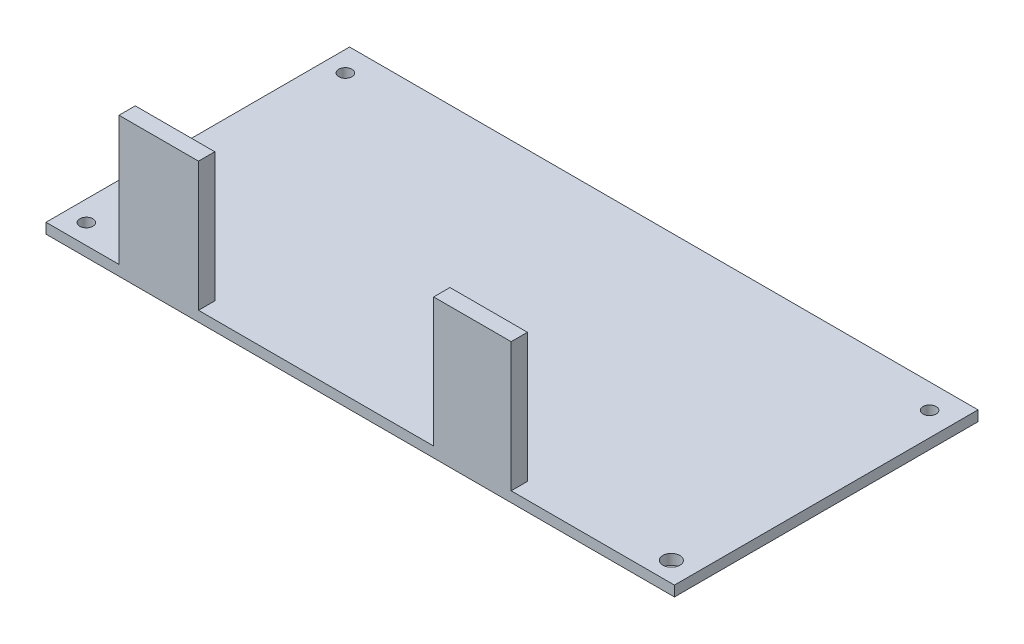
ISO-10303-21;
HEADER;
FILE_DESCRIPTION(('STEP AP214'),'2;1');
FILE_NAME('part.step','',(''),(''),'','','');
FILE_SCHEMA(('AUTOMOTIVE_DESIGN { 1 0 10303 214 1 1 1 1 }'));
ENDSEC;
DATA;
#1=APPLICATION_CONTEXT('core data for automotive mechanical design processes');
#2=APPLICATION_PROTOCOL_DEFINITION('international standard','automotive_design',2000,#1);
#3=PRODUCT_CONTEXT('',#1,'mechanical');
#4=PRODUCT('Part','Part','',(#3));
#5=PRODUCT_RELATED_PRODUCT_CATEGORY('part','',(#4));
#6=PRODUCT_DEFINITION_FORMATION('','',#4);
#7=PRODUCT_DEFINITION_CONTEXT('part definition',#1,'design');
#8=PRODUCT_DEFINITION('design','',#6,#7);
#9=PRODUCT_DEFINITION_SHAPE('','',#8);
#10=(LENGTH_UNIT() NAMED_UNIT(*) SI_UNIT(.MILLI.,.METRE.));
#11=(NAMED_UNIT(*) PLANE_ANGLE_UNIT() SI_UNIT($,.RADIAN.));
#12=(NAMED_UNIT(*) SI_UNIT($,.STERADIAN.) SOLID_ANGLE_UNIT());
#13=UNCERTAINTY_MEASURE_WITH_UNIT(LENGTH_MEASURE(1.E-05),#10,'distance_accuracy_value','');
#14=(GEOMETRIC_REPRESENTATION_CONTEXT(3) GLOBAL_UNCERTAINTY_ASSIGNED_CONTEXT((#13)) GLOBAL_UNIT_ASSIGNED_CONTEXT((#10,
#11,#12)) REPRESENTATION_CONTEXT('',''));
#15=CARTESIAN_POINT('',(0.,0.,0.));
#16=DIRECTION('',(0.,0.,1.));
#17=DIRECTION('',(1.,0.,0.));
#18=AXIS2_PLACEMENT_3D('',#15,#16,#17);
#19=CARTESIAN_POINT('',(0.,1.6,0.));
#20=DIRECTION('',(0.,1.,0.));
#21=DIRECTION('',(0.,0.,1.));
#22=AXIS2_PLACEMENT_3D('',#19,#20,#21);
#23=PLANE('',#22);
#24=CARTESIAN_POINT('',(93.617,1.6,3.81));
#25=DIRECTION('',(0.,1.,0.));
#26=DIRECTION('',(0.,0.,1.));
#27=AXIS2_PLACEMENT_3D('',#24,#25,#26);
#28=CIRCLE('',#27,1.016);
#29=CARTESIAN_POINT('',(93.617,1.6,4.826));
#30=VERTEX_POINT('',#29);
#31=EDGE_CURVE('E387',#30,#30,#28,.T.);
#32=ORIENTED_EDGE('',*,*,#31,.F.);
#33=EDGE_LOOP('',(#32));
#34=FACE_BOUND('',#33,.T.);
#35=CARTESIAN_POINT('',(93.744,1.6,43.916));
#36=DIRECTION('',(0.,1.,0.));
#37=DIRECTION('',(0.,0.,1.));
#38=AXIS2_PLACEMENT_3D('',#35,#36,#37);
#39=CIRCLE('',#38,1.316);
#40=CARTESIAN_POINT('',(93.744,1.6,45.232));
#41=VERTEX_POINT('',#40);
#42=EDGE_CURVE('E393',#41,#41,#39,.T.);
#43=ORIENTED_EDGE('',*,*,#42,.F.);
#44=EDGE_LOOP('',(#43));
#45=FACE_BOUND('',#44,.T.);
#46=CARTESIAN_POINT('',(3.16,1.6,43.916));
#47=DIRECTION('',(0.,1.,0.));
#48=DIRECTION('',(0.,0.,1.));
#49=AXIS2_PLACEMENT_3D('',#46,#47,#48);
#50=CIRCLE('',#49,1.016);
#51=CARTESIAN_POINT('',(3.16,1.6,44.932));
#52=VERTEX_POINT('',#51);
#53=EDGE_CURVE('E401',#52,#52,#50,.T.);
#54=ORIENTED_EDGE('',*,*,#53,.F.);
#55=EDGE_LOOP('',(#54));
#56=FACE_BOUND('',#55,.T.);
#57=CARTESIAN_POINT('',(3.16,1.6,3.81));
#58=DIRECTION('',(0.,1.,0.));
#59=DIRECTION('',(0.,0.,1.));
#60=AXIS2_PLACEMENT_3D('',#57,#58,#59);
#61=CIRCLE('',#60,1.016);
#62=CARTESIAN_POINT('',(3.16,1.6,4.826));
#63=VERTEX_POINT('',#62);
#64=EDGE_CURVE('E390',#63,#63,#61,.T.);
#65=ORIENTED_EDGE('',*,*,#64,.F.);
#66=EDGE_LOOP('',(#65));
#67=FACE_BOUND('',#66,.T.);
#68=DIRECTION('',(1.,0.,0.));
#69=VECTOR('',#68,1.);
#70=CARTESIAN_POINT('',(0.,1.6,47.));
#71=LINE('',#70,#69);
#72=CARTESIAN_POINT('',(23.6114774653231,1.6,47.));
#73=VERTEX_POINT('',#72);
#74=CARTESIAN_POINT('',(60.0201337686883,1.6,47.));
#75=VERTEX_POINT('',#74);
#76=EDGE_CURVE('E188',#73,#75,#71,.T.);
#77=ORIENTED_EDGE('',*,*,#76,.T.);
#78=DIRECTION('',(0.,0.,1.));
#79=VECTOR('',#78,1.);
#80=CARTESIAN_POINT('',(60.0201337686883,1.6,47.));
#81=LINE('',#80,#79);
#82=CARTESIAN_POINT('',(60.0201337686883,1.6,44.4786423259416));
#83=VERTEX_POINT('',#82);
#84=EDGE_CURVE('E146',#83,#75,#81,.T.);
#85=ORIENTED_EDGE('',*,*,#84,.F.);
#86=DIRECTION('',(-1.,0.,0.));
#87=VECTOR('',#86,1.);
#88=CARTESIAN_POINT('',(60.0201337686883,1.6,44.4786423259416));
#89=LINE('',#88,#87);
#90=CARTESIAN_POINT('',(72.0180133010615,1.6,44.4786423259416));
#91=VERTEX_POINT('',#90);
#92=EDGE_CURVE('E142',#91,#83,#89,.T.);
#93=ORIENTED_EDGE('',*,*,#92,.F.);
#94=DIRECTION('',(0.,0.,-1.));
#95=VECTOR('',#94,1.);
#96=CARTESIAN_POINT('',(72.0180133010615,1.6,47.));
#97=LINE('',#96,#95);
#98=CARTESIAN_POINT('',(72.0180133010615,1.6,47.));
#99=VERTEX_POINT('',#98);
#100=EDGE_CURVE('E224',#99,#91,#97,.T.);
#101=ORIENTED_EDGE('',*,*,#100,.F.);
#102=CARTESIAN_POINT('',(97.3,1.6,47.));
#103=VERTEX_POINT('',#102);
#104=EDGE_CURVE('E183',#99,#103,#71,.T.);
#105=ORIENTED_EDGE('',*,*,#104,.T.);
#106=DIRECTION('',(0.,0.,-1.));
#107=VECTOR('',#106,1.);
#108=CARTESIAN_POINT('',(97.3,1.6,0.));
#109=LINE('',#108,#107);
#110=CARTESIAN_POINT('',(97.3,1.6,0.));
#111=VERTEX_POINT('',#110);
#112=EDGE_CURVE('E187',#103,#111,#109,.T.);
#113=ORIENTED_EDGE('',*,*,#112,.T.);
#114=DIRECTION('',(-1.,0.,0.));
#115=VECTOR('',#114,1.);
#116=CARTESIAN_POINT('',(0.,1.6,0.));
#117=LINE('',#116,#115);
#118=CARTESIAN_POINT('',(0.,1.6,0.));
#119=VERTEX_POINT('',#118);
#120=EDGE_CURVE('E190',#111,#119,#117,.T.);
#121=ORIENTED_EDGE('',*,*,#120,.T.);
#122=DIRECTION('',(0.,0.,1.));
#123=VECTOR('',#122,1.);
#124=CARTESIAN_POINT('',(0.,1.6,0.));
#125=LINE('',#124,#123);
#126=CARTESIAN_POINT('',(0.,1.6,47.));
#127=VERTEX_POINT('',#126);
#128=EDGE_CURVE('E180',#119,#127,#125,.T.);
#129=ORIENTED_EDGE('',*,*,#128,.T.);
#130=CARTESIAN_POINT('',(11.3007204590474,1.6,47.));
#131=VERTEX_POINT('',#130);
#132=EDGE_CURVE('E185',#127,#131,#71,.T.);
#133=ORIENTED_EDGE('',*,*,#132,.T.);
#134=DIRECTION('',(0.,0.,1.));
#135=VECTOR('',#134,1.);
#136=CARTESIAN_POINT('',(11.3007204590474,1.6,47.));
#137=LINE('',#136,#135);
#138=CARTESIAN_POINT('',(11.3007204590474,1.6,44.4786423259416));
#139=VERTEX_POINT('',#138);
#140=EDGE_CURVE('E56',#139,#131,#137,.T.);
#141=ORIENTED_EDGE('',*,*,#140,.F.);
#142=DIRECTION('',(-1.,0.,0.));
#143=VECTOR('',#142,1.);
#144=CARTESIAN_POINT('',(11.3007204590474,1.6,44.4786423259416));
#145=LINE('',#144,#143);
#146=CARTESIAN_POINT('',(23.6114774653231,1.6,44.4786423259416));
#147=VERTEX_POINT('',#146);
#148=EDGE_CURVE('E158',#147,#139,#145,.T.);
#149=ORIENTED_EDGE('',*,*,#148,.F.);
#150=DIRECTION('',(0.,0.,-1.));
#151=VECTOR('',#150,1.);
#152=CARTESIAN_POINT('',(23.6114774653231,1.6,47.));
#153=LINE('',#152,#151);
#154=EDGE_CURVE('E149',#73,#147,#153,.T.);
#155=ORIENTED_EDGE('',*,*,#154,.F.);
#156=EDGE_LOOP('',(#77,#85,#93,#101,#105,#113,#121,#129,#133,#141,#149,#155));
#157=FACE_BOUND('',#156,.T.);
#158=ADVANCED_FACE('F33',(#34,#45,#56,#67,#157),#23,.T.);
#159=CARTESIAN_POINT('',(0.,1.6,0.));
#160=DIRECTION('',(1.,0.,0.));
#161=DIRECTION('',(0.,0.,-1.));
#162=AXIS2_PLACEMENT_3D('',#159,#160,#161);
#163=PLANE('',#162);
#164=DIRECTION('',(0.,0.,1.));
#165=VECTOR('',#164,1.);
#166=CARTESIAN_POINT('',(0.,0.,0.));
#167=LINE('',#166,#165);
#168=CARTESIAN_POINT('',(0.,0.,0.));
#169=VERTEX_POINT('',#168);
#170=CARTESIAN_POINT('',(0.,0.,47.));
#171=VERTEX_POINT('',#170);
#172=EDGE_CURVE('E179',#169,#171,#167,.T.);
#173=ORIENTED_EDGE('',*,*,#172,.T.);
#174=DIRECTION('',(0.,-1.,0.));
#175=VECTOR('',#174,1.);
#176=CARTESIAN_POINT('',(0.,1.6,47.));
#177=LINE('',#176,#175);
#178=EDGE_CURVE('E11',#127,#171,#177,.T.);
#179=ORIENTED_EDGE('',*,*,#178,.F.);
#180=ORIENTED_EDGE('',*,*,#128,.F.);
#181=DIRECTION('',(0.,-1.,0.));
#182=VECTOR('',#181,1.);
#183=CARTESIAN_POINT('',(0.,1.6,0.));
#184=LINE('',#183,#182);
#185=EDGE_CURVE('E192',#119,#169,#184,.T.);
#186=ORIENTED_EDGE('',*,*,#185,.T.);
#187=EDGE_LOOP('',(#173,#179,#180,#186));
#188=FACE_BOUND('',#187,.T.);
#189=ADVANCED_FACE('F35',(#188),#163,.F.);
#190=CARTESIAN_POINT('',(0.,1.6,47.));
#191=DIRECTION('',(0.,0.,-1.));
#192=DIRECTION('',(-1.,0.,0.));
#193=AXIS2_PLACEMENT_3D('',#190,#191,#192);
#194=PLANE('',#193);
#195=DIRECTION('',(1.,0.,0.));
#196=VECTOR('',#195,1.);
#197=CARTESIAN_POINT('',(0.,0.,47.));
#198=LINE('',#197,#196);
#199=CARTESIAN_POINT('',(97.3,0.,47.));
#200=VERTEX_POINT('',#199);
#201=EDGE_CURVE('E195',#171,#200,#198,.T.);
#202=ORIENTED_EDGE('',*,*,#201,.T.);
#203=DIRECTION('',(0.,-1.,0.));
#204=VECTOR('',#203,1.);
#205=CARTESIAN_POINT('',(97.3,1.6,47.));
#206=LINE('',#205,#204);
#207=EDGE_CURVE('E41',#103,#200,#206,.T.);
#208=ORIENTED_EDGE('',*,*,#207,.F.);
#209=ORIENTED_EDGE('',*,*,#104,.F.);
#210=DIRECTION('',(0.,-1.,0.));
#211=VECTOR('',#210,1.);
#212=CARTESIAN_POINT('',(72.0180133010615,21.6,47.));
#213=LINE('',#212,#211);
#214=CARTESIAN_POINT('',(72.0180133010615,21.6,47.));
#215=VERTEX_POINT('',#214);
#216=EDGE_CURVE('E130',#215,#99,#213,.T.);
#217=ORIENTED_EDGE('',*,*,#216,.F.);
#218=DIRECTION('',(1.,0.,0.));
#219=VECTOR('',#218,1.);
#220=CARTESIAN_POINT('',(60.0201337686883,21.6,47.));
#221=LINE('',#220,#219);
#222=CARTESIAN_POINT('',(60.0201337686883,21.6,47.));
#223=VERTEX_POINT('',#222);
#224=EDGE_CURVE('E122',#223,#215,#221,.T.);
#225=ORIENTED_EDGE('',*,*,#224,.F.);
#226=DIRECTION('',(0.,-1.,0.));
#227=VECTOR('',#226,1.);
#228=CARTESIAN_POINT('',(60.0201337686883,21.6,47.));
#229=LINE('',#228,#227);
#230=EDGE_CURVE('E127',#223,#75,#229,.T.);
#231=ORIENTED_EDGE('',*,*,#230,.T.);
#232=ORIENTED_EDGE('',*,*,#76,.F.);
#233=DIRECTION('',(0.,-1.,0.));
#234=VECTOR('',#233,1.);
#235=CARTESIAN_POINT('',(23.6114774653231,21.6,47.));
#236=LINE('',#235,#234);
#237=CARTESIAN_POINT('',(23.6114774653231,21.6,47.));
#238=VERTEX_POINT('',#237);
#239=EDGE_CURVE('E173',#238,#73,#236,.T.);
#240=ORIENTED_EDGE('',*,*,#239,.F.);
#241=DIRECTION('',(1.,0.,0.));
#242=VECTOR('',#241,1.);
#243=CARTESIAN_POINT('',(11.3007204590474,21.6,47.));
#244=LINE('',#243,#242);
#245=CARTESIAN_POINT('',(11.3007204590474,21.6,47.));
#246=VERTEX_POINT('',#245);
#247=EDGE_CURVE('E157',#246,#238,#244,.T.);
#248=ORIENTED_EDGE('',*,*,#247,.F.);
#249=DIRECTION('',(0.,-1.,0.));
#250=VECTOR('',#249,1.);
#251=CARTESIAN_POINT('',(11.3007204590474,21.6,47.));
#252=LINE('',#251,#250);
#253=EDGE_CURVE('E176',#246,#131,#252,.T.);
#254=ORIENTED_EDGE('',*,*,#253,.T.);
#255=ORIENTED_EDGE('',*,*,#132,.F.);
#256=ORIENTED_EDGE('',*,*,#178,.T.);
#257=EDGE_LOOP('',(#202,#208,#209,#217,#225,#231,#232,#240,#248,#254,#255,#256));
#258=FACE_BOUND('',#257,.T.);
#259=ADVANCED_FACE('F124',(#258),#194,.F.);
#260=CARTESIAN_POINT('',(97.3,1.6,0.));
#261=DIRECTION('',(-1.,0.,0.));
#262=DIRECTION('',(0.,0.,1.));
#263=AXIS2_PLACEMENT_3D('',#260,#261,#262);
#264=PLANE('',#263);
#265=DIRECTION('',(0.,0.,-1.));
#266=VECTOR('',#265,1.);
#267=CARTESIAN_POINT('',(97.3,0.,0.));
#268=LINE('',#267,#266);
#269=CARTESIAN_POINT('',(97.3,0.,0.));
#270=VERTEX_POINT('',#269);
#271=EDGE_CURVE('E197',#200,#270,#268,.T.);
#272=ORIENTED_EDGE('',*,*,#271,.T.);
#273=DIRECTION('',(0.,-1.,0.));
#274=VECTOR('',#273,1.);
#275=CARTESIAN_POINT('',(97.3,1.6,0.));
#276=LINE('',#275,#274);
#277=EDGE_CURVE('E202',#111,#270,#276,.T.);
#278=ORIENTED_EDGE('',*,*,#277,.F.);
#279=ORIENTED_EDGE('',*,*,#112,.F.);
#280=ORIENTED_EDGE('',*,*,#207,.T.);
#281=EDGE_LOOP('',(#272,#278,#279,#280));
#282=FACE_BOUND('',#281,.T.);
#283=ADVANCED_FACE('F209',(#282),#264,.F.);
#284=CARTESIAN_POINT('',(0.,1.6,0.));
#285=DIRECTION('',(0.,0.,1.));
#286=DIRECTION('',(1.,0.,0.));
#287=AXIS2_PLACEMENT_3D('',#284,#285,#286);
#288=PLANE('',#287);
#289=DIRECTION('',(-1.,0.,0.));
#290=VECTOR('',#289,1.);
#291=CARTESIAN_POINT('',(0.,0.,0.));
#292=LINE('',#291,#290);
#293=EDGE_CURVE('E184',#270,#169,#292,.T.);
#294=ORIENTED_EDGE('',*,*,#293,.T.);
#295=ORIENTED_EDGE('',*,*,#185,.F.);
#296=ORIENTED_EDGE('',*,*,#120,.F.);
#297=ORIENTED_EDGE('',*,*,#277,.T.);
#298=EDGE_LOOP('',(#294,#295,#296,#297));
#299=FACE_BOUND('',#298,.T.);
#300=ADVANCED_FACE('F217',(#299),#288,.F.);
#301=CARTESIAN_POINT('',(0.,0.,0.));
#302=DIRECTION('',(0.,1.,0.));
#303=DIRECTION('',(0.,0.,1.));
#304=AXIS2_PLACEMENT_3D('',#301,#302,#303);
#305=PLANE('',#304);
#306=CARTESIAN_POINT('',(93.617,0.,3.81));
#307=DIRECTION('',(0.,1.,0.));
#308=DIRECTION('',(0.,0.,1.));
#309=AXIS2_PLACEMENT_3D('',#306,#307,#308);
#310=CIRCLE('',#309,1.016);
#311=CARTESIAN_POINT('',(93.617,0.,4.826));
#312=VERTEX_POINT('',#311);
#313=EDGE_CURVE('E385',#312,#312,#310,.T.);
#314=ORIENTED_EDGE('',*,*,#313,.T.);
#315=EDGE_LOOP('',(#314));
#316=FACE_BOUND('',#315,.T.);
#317=CARTESIAN_POINT('',(93.744,0.,43.916));
#318=DIRECTION('',(0.,1.,0.));
#319=DIRECTION('',(0.,0.,1.));
#320=AXIS2_PLACEMENT_3D('',#317,#318,#319);
#321=CIRCLE('',#320,1.316);
#322=CARTESIAN_POINT('',(93.744,0.,45.232));
#323=VERTEX_POINT('',#322);
#324=EDGE_CURVE('E388',#323,#323,#321,.T.);
#325=ORIENTED_EDGE('',*,*,#324,.T.);
#326=EDGE_LOOP('',(#325));
#327=FACE_BOUND('',#326,.T.);
#328=CARTESIAN_POINT('',(3.16,0.,43.916));
#329=DIRECTION('',(0.,1.,0.));
#330=DIRECTION('',(0.,0.,1.));
#331=AXIS2_PLACEMENT_3D('',#328,#329,#330);
#332=CIRCLE('',#331,1.016);
#333=CARTESIAN_POINT('',(3.16,0.,44.932));
#334=VERTEX_POINT('',#333);
#335=EDGE_CURVE('E398',#334,#334,#332,.T.);
#336=ORIENTED_EDGE('',*,*,#335,.T.);
#337=EDGE_LOOP('',(#336));
#338=FACE_BOUND('',#337,.T.);
#339=CARTESIAN_POINT('',(3.16,0.,3.81));
#340=DIRECTION('',(0.,1.,0.));
#341=DIRECTION('',(0.,0.,1.));
#342=AXIS2_PLACEMENT_3D('',#339,#340,#341);
#343=CIRCLE('',#342,1.016);
#344=CARTESIAN_POINT('',(3.16,0.,4.826));
#345=VERTEX_POINT('',#344);
#346=EDGE_CURVE('E404',#345,#345,#343,.T.);
#347=ORIENTED_EDGE('',*,*,#346,.T.);
#348=EDGE_LOOP('',(#347));
#349=FACE_BOUND('',#348,.T.);
#350=ORIENTED_EDGE('',*,*,#172,.F.);
#351=ORIENTED_EDGE('',*,*,#293,.F.);
#352=ORIENTED_EDGE('',*,*,#271,.F.);
#353=ORIENTED_EDGE('',*,*,#201,.F.);
#354=EDGE_LOOP('',(#350,#351,#352,#353));
#355=FACE_BOUND('',#354,.T.);
#356=ADVANCED_FACE('F214',(#316,#327,#338,#349,#355),#305,.F.);
#357=CARTESIAN_POINT('',(11.3007204590474,21.6,47.));
#358=DIRECTION('',(1.,0.,0.));
#359=DIRECTION('',(0.,0.,-1.));
#360=AXIS2_PLACEMENT_3D('',#357,#358,#359);
#361=PLANE('',#360);
#362=ORIENTED_EDGE('',*,*,#140,.T.);
#363=ORIENTED_EDGE('',*,*,#253,.F.);
#364=DIRECTION('',(0.,0.,1.));
#365=VECTOR('',#364,1.);
#366=CARTESIAN_POINT('',(11.3007204590474,21.6,47.));
#367=LINE('',#366,#365);
#368=CARTESIAN_POINT('',(11.3007204590474,21.6,44.4786423259416));
#369=VERTEX_POINT('',#368);
#370=EDGE_CURVE('E154',#369,#246,#367,.T.);
#371=ORIENTED_EDGE('',*,*,#370,.F.);
#372=DIRECTION('',(0.,-1.,0.));
#373=VECTOR('',#372,1.);
#374=CARTESIAN_POINT('',(11.3007204590474,21.6,44.4786423259416));
#375=LINE('',#374,#373);
#376=EDGE_CURVE('E163',#369,#139,#375,.T.);
#377=ORIENTED_EDGE('',*,*,#376,.T.);
#378=EDGE_LOOP('',(#362,#363,#371,#377));
#379=FACE_BOUND('',#378,.T.);
#380=ADVANCED_FACE('F237',(#379),#361,.F.);
#381=CARTESIAN_POINT('',(23.6114774653231,21.6,47.));
#382=DIRECTION('',(-1.,0.,0.));
#383=DIRECTION('',(0.,0.,1.));
#384=AXIS2_PLACEMENT_3D('',#381,#382,#383);
#385=PLANE('',#384);
#386=ORIENTED_EDGE('',*,*,#154,.T.);
#387=DIRECTION('',(0.,-1.,0.));
#388=VECTOR('',#387,1.);
#389=CARTESIAN_POINT('',(23.6114774653231,21.6,44.4786423259416));
#390=LINE('',#389,#388);
#391=CARTESIAN_POINT('',(23.6114774653231,21.6,44.4786423259416));
#392=VERTEX_POINT('',#391);
#393=EDGE_CURVE('E170',#392,#147,#390,.T.);
#394=ORIENTED_EDGE('',*,*,#393,.F.);
#395=DIRECTION('',(0.,0.,-1.));
#396=VECTOR('',#395,1.);
#397=CARTESIAN_POINT('',(23.6114774653231,21.6,47.));
#398=LINE('',#397,#396);
#399=EDGE_CURVE('E160',#238,#392,#398,.T.);
#400=ORIENTED_EDGE('',*,*,#399,.F.);
#401=ORIENTED_EDGE('',*,*,#239,.T.);
#402=EDGE_LOOP('',(#386,#394,#400,#401));
#403=FACE_BOUND('',#402,.T.);
#404=ADVANCED_FACE('F228',(#403),#385,.F.);
#405=CARTESIAN_POINT('',(11.3007204590474,21.6,44.4786423259416));
#406=DIRECTION('',(0.,0.,1.));
#407=DIRECTION('',(1.,0.,0.));
#408=AXIS2_PLACEMENT_3D('',#405,#406,#407);
#409=PLANE('',#408);
#410=ORIENTED_EDGE('',*,*,#148,.T.);
#411=ORIENTED_EDGE('',*,*,#376,.F.);
#412=DIRECTION('',(-1.,0.,0.));
#413=VECTOR('',#412,1.);
#414=CARTESIAN_POINT('',(11.3007204590474,21.6,44.4786423259416));
#415=LINE('',#414,#413);
#416=EDGE_CURVE('E162',#392,#369,#415,.T.);
#417=ORIENTED_EDGE('',*,*,#416,.F.);
#418=ORIENTED_EDGE('',*,*,#393,.T.);
#419=EDGE_LOOP('',(#410,#411,#417,#418));
#420=FACE_BOUND('',#419,.T.);
#421=ADVANCED_FACE('F239',(#420),#409,.F.);
#422=CARTESIAN_POINT('',(0.,21.6,0.));
#423=DIRECTION('',(0.,-1.,0.));
#424=DIRECTION('',(0.,0.,-1.));
#425=AXIS2_PLACEMENT_3D('',#422,#423,#424);
#426=PLANE('',#425);
#427=ORIENTED_EDGE('',*,*,#370,.T.);
#428=ORIENTED_EDGE('',*,*,#247,.T.);
#429=ORIENTED_EDGE('',*,*,#399,.T.);
#430=ORIENTED_EDGE('',*,*,#416,.T.);
#431=EDGE_LOOP('',(#427,#428,#429,#430));
#432=FACE_BOUND('',#431,.T.);
#433=ADVANCED_FACE('F232',(#432),#426,.F.);
#434=CARTESIAN_POINT('',(60.0201337686883,21.6,47.));
#435=DIRECTION('',(1.,0.,0.));
#436=DIRECTION('',(0.,0.,-1.));
#437=AXIS2_PLACEMENT_3D('',#434,#435,#436);
#438=PLANE('',#437);
#439=ORIENTED_EDGE('',*,*,#84,.T.);
#440=ORIENTED_EDGE('',*,*,#230,.F.);
#441=DIRECTION('',(0.,0.,1.));
#442=VECTOR('',#441,1.);
#443=CARTESIAN_POINT('',(60.0201337686883,21.6,47.));
#444=LINE('',#443,#442);
#445=CARTESIAN_POINT('',(60.0201337686883,21.6,44.4786423259416));
#446=VERTEX_POINT('',#445);
#447=EDGE_CURVE('E134',#446,#223,#444,.T.);
#448=ORIENTED_EDGE('',*,*,#447,.F.);
#449=DIRECTION('',(0.,-1.,0.));
#450=VECTOR('',#449,1.);
#451=CARTESIAN_POINT('',(60.0201337686883,21.6,44.4786423259416));
#452=LINE('',#451,#450);
#453=EDGE_CURVE('E411',#446,#83,#452,.T.);
#454=ORIENTED_EDGE('',*,*,#453,.T.);
#455=EDGE_LOOP('',(#439,#440,#448,#454));
#456=FACE_BOUND('',#455,.T.);
#457=ADVANCED_FACE('F144',(#456),#438,.F.);
#458=CARTESIAN_POINT('',(72.0180133010615,21.6,47.));
#459=DIRECTION('',(-1.,0.,0.));
#460=DIRECTION('',(0.,0.,1.));
#461=AXIS2_PLACEMENT_3D('',#458,#459,#460);
#462=PLANE('',#461);
#463=ORIENTED_EDGE('',*,*,#100,.T.);
#464=DIRECTION('',(0.,-1.,0.));
#465=VECTOR('',#464,1.);
#466=CARTESIAN_POINT('',(72.0180133010615,21.6,44.4786423259416));
#467=LINE('',#466,#465);
#468=CARTESIAN_POINT('',(72.0180133010615,21.6,44.4786423259416));
#469=VERTEX_POINT('',#468);
#470=EDGE_CURVE('E48',#469,#91,#467,.T.);
#471=ORIENTED_EDGE('',*,*,#470,.F.);
#472=DIRECTION('',(0.,0.,-1.));
#473=VECTOR('',#472,1.);
#474=CARTESIAN_POINT('',(72.0180133010615,21.6,47.));
#475=LINE('',#474,#473);
#476=EDGE_CURVE('E133',#215,#469,#475,.T.);
#477=ORIENTED_EDGE('',*,*,#476,.F.);
#478=ORIENTED_EDGE('',*,*,#216,.T.);
#479=EDGE_LOOP('',(#463,#471,#477,#478));
#480=FACE_BOUND('',#479,.T.);
#481=ADVANCED_FACE('F314',(#480),#462,.F.);
#482=CARTESIAN_POINT('',(60.0201337686883,21.6,44.4786423259416));
#483=DIRECTION('',(0.,0.,1.));
#484=DIRECTION('',(1.,0.,0.));
#485=AXIS2_PLACEMENT_3D('',#482,#483,#484);
#486=PLANE('',#485);
#487=ORIENTED_EDGE('',*,*,#92,.T.);
#488=ORIENTED_EDGE('',*,*,#453,.F.);
#489=DIRECTION('',(-1.,0.,0.));
#490=VECTOR('',#489,1.);
#491=CARTESIAN_POINT('',(60.0201337686883,21.6,44.4786423259416));
#492=LINE('',#491,#490);
#493=EDGE_CURVE('E138',#469,#446,#492,.T.);
#494=ORIENTED_EDGE('',*,*,#493,.F.);
#495=ORIENTED_EDGE('',*,*,#470,.T.);
#496=EDGE_LOOP('',(#487,#488,#494,#495));
#497=FACE_BOUND('',#496,.T.);
#498=ADVANCED_FACE('F323',(#497),#486,.F.);
#499=CARTESIAN_POINT('',(0.,21.6,0.));
#500=DIRECTION('',(0.,-1.,0.));
#501=DIRECTION('',(0.,0.,-1.));
#502=AXIS2_PLACEMENT_3D('',#499,#500,#501);
#503=PLANE('',#502);
#504=ORIENTED_EDGE('',*,*,#447,.T.);
#505=ORIENTED_EDGE('',*,*,#224,.T.);
#506=ORIENTED_EDGE('',*,*,#476,.T.);
#507=ORIENTED_EDGE('',*,*,#493,.T.);
#508=EDGE_LOOP('',(#504,#505,#506,#507));
#509=FACE_BOUND('',#508,.T.);
#510=ADVANCED_FACE('F137',(#509),#503,.F.);
#511=CARTESIAN_POINT('',(3.16,0.,3.81));
#512=DIRECTION('',(0.,1.,0.));
#513=DIRECTION('',(0.,0.,1.));
#514=AXIS2_PLACEMENT_3D('',#511,#512,#513);
#515=CYLINDRICAL_SURFACE('',#514,1.016);
#516=ORIENTED_EDGE('',*,*,#346,.F.);
#517=EDGE_LOOP('',(#516));
#518=FACE_BOUND('',#517,.T.);
#519=ORIENTED_EDGE('',*,*,#64,.T.);
#520=EDGE_LOOP('',(#519));
#521=FACE_BOUND('',#520,.T.);
#522=ADVANCED_FACE('F339',(#518,#521),#515,.F.);
#523=CARTESIAN_POINT('',(3.16,0.,43.916));
#524=DIRECTION('',(0.,1.,0.));
#525=DIRECTION('',(0.,0.,1.));
#526=AXIS2_PLACEMENT_3D('',#523,#524,#525);
#527=CYLINDRICAL_SURFACE('',#526,1.016);
#528=ORIENTED_EDGE('',*,*,#335,.F.);
#529=EDGE_LOOP('',(#528));
#530=FACE_BOUND('',#529,.T.);
#531=ORIENTED_EDGE('',*,*,#53,.T.);
#532=EDGE_LOOP('',(#531));
#533=FACE_BOUND('',#532,.T.);
#534=ADVANCED_FACE('F348',(#530,#533),#527,.F.);
#535=CARTESIAN_POINT('',(93.744,0.,43.916));
#536=DIRECTION('',(0.,1.,0.));
#537=DIRECTION('',(0.,0.,1.));
#538=AXIS2_PLACEMENT_3D('',#535,#536,#537);
#539=CYLINDRICAL_SURFACE('',#538,1.316);
#540=ORIENTED_EDGE('',*,*,#324,.F.);
#541=EDGE_LOOP('',(#540));
#542=FACE_BOUND('',#541,.T.);
#543=ORIENTED_EDGE('',*,*,#42,.T.);
#544=EDGE_LOOP('',(#543));
#545=FACE_BOUND('',#544,.T.);
#546=ADVANCED_FACE('F355',(#542,#545),#539,.F.);
#547=CARTESIAN_POINT('',(93.617,0.,3.81));
#548=DIRECTION('',(0.,1.,0.));
#549=DIRECTION('',(0.,0.,1.));
#550=AXIS2_PLACEMENT_3D('',#547,#548,#549);
#551=CYLINDRICAL_SURFACE('',#550,1.016);
#552=ORIENTED_EDGE('',*,*,#313,.F.);
#553=EDGE_LOOP('',(#552));
#554=FACE_BOUND('',#553,.T.);
#555=ORIENTED_EDGE('',*,*,#31,.T.);
#556=EDGE_LOOP('',(#555));
#557=FACE_BOUND('',#556,.T.);
#558=ADVANCED_FACE('F363',(#554,#557),#551,.F.);
#559=CLOSED_SHELL('',(#158,#189,#259,#283,#300,#356,#380,#404,#421,#433,#457,#481,#498,#510,
#522,#534,#546,#558));
#560=MANIFOLD_SOLID_BREP('B2',#559);
#561=ADVANCED_BREP_SHAPE_REPRESENTATION('',(#18,#560),#14);
#562=SHAPE_DEFINITION_REPRESENTATION(#9,#561);
ENDSEC;
END-ISO-10303-21;
